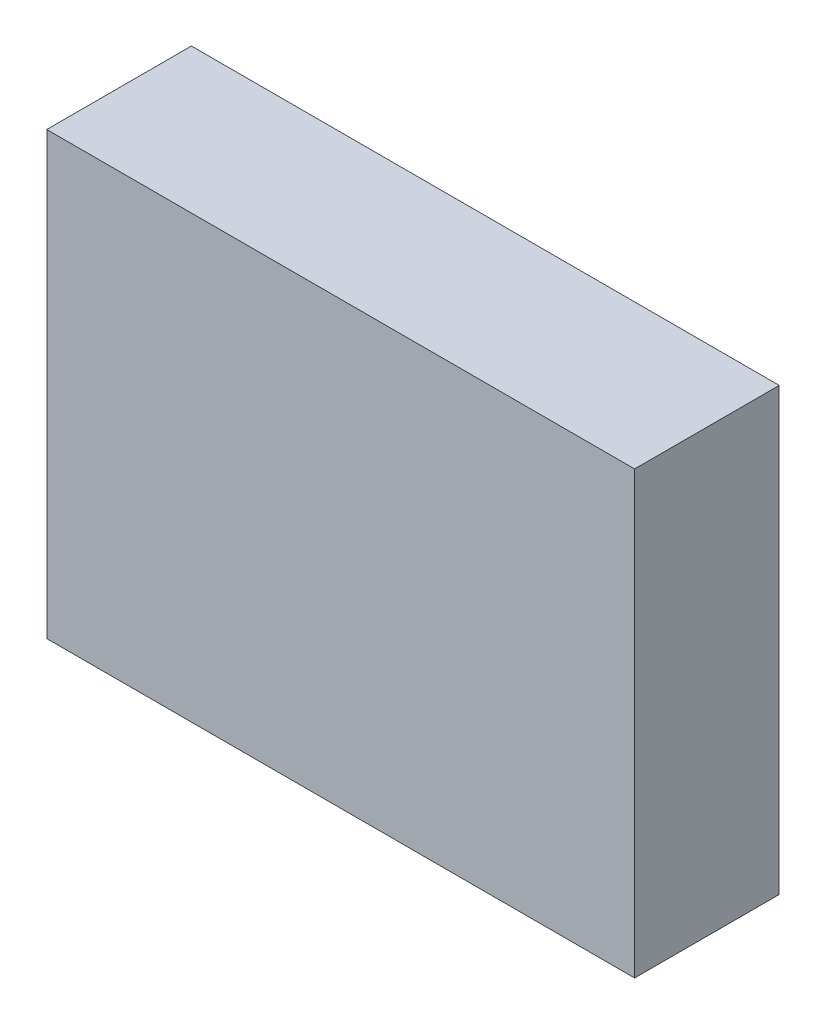
ISO-10303-21;
HEADER;
FILE_DESCRIPTION(('STEP AP214'),'2;1');
FILE_NAME('part.step','',(''),(''),'','','');
FILE_SCHEMA(('AUTOMOTIVE_DESIGN { 1 0 10303 214 1 1 1 1 }'));
ENDSEC;
DATA;
#1=APPLICATION_CONTEXT('core data for automotive mechanical design processes');
#2=APPLICATION_PROTOCOL_DEFINITION('international standard','automotive_design',2000,#1);
#3=PRODUCT_CONTEXT('',#1,'mechanical');
#4=PRODUCT('Part','Part','',(#3));
#5=PRODUCT_RELATED_PRODUCT_CATEGORY('part','',(#4));
#6=PRODUCT_DEFINITION_FORMATION('','',#4);
#7=PRODUCT_DEFINITION_CONTEXT('part definition',#1,'design');
#8=PRODUCT_DEFINITION('design','',#6,#7);
#9=PRODUCT_DEFINITION_SHAPE('','',#8);
#10=(LENGTH_UNIT() NAMED_UNIT(*) SI_UNIT(.MILLI.,.METRE.));
#11=(NAMED_UNIT(*) PLANE_ANGLE_UNIT() SI_UNIT($,.RADIAN.));
#12=(NAMED_UNIT(*) SI_UNIT($,.STERADIAN.) SOLID_ANGLE_UNIT());
#13=UNCERTAINTY_MEASURE_WITH_UNIT(LENGTH_MEASURE(1.E-05),#10,'distance_accuracy_value','');
#14=(GEOMETRIC_REPRESENTATION_CONTEXT(3) GLOBAL_UNCERTAINTY_ASSIGNED_CONTEXT((#13)) GLOBAL_UNIT_ASSIGNED_CONTEXT((#10,
#11,#12)) REPRESENTATION_CONTEXT('',''));
#15=CARTESIAN_POINT('',(0.,0.,0.));
#16=DIRECTION('',(0.,0.,1.));
#17=DIRECTION('',(1.,0.,0.));
#18=AXIS2_PLACEMENT_3D('',#15,#16,#17);
#19=CARTESIAN_POINT('',(-2.032,-1.524,1.));
#20=DIRECTION('',(1.,0.,0.));
#21=DIRECTION('',(0.,0.,-1.));
#22=AXIS2_PLACEMENT_3D('',#19,#20,#21);
#23=PLANE('',#22);
#24=DIRECTION('',(0.,-1.,0.));
#25=VECTOR('',#24,1.);
#26=CARTESIAN_POINT('',(-2.032,-1.524,0.));
#27=LINE('',#26,#25);
#28=CARTESIAN_POINT('',(-2.032,1.524,0.));
#29=VERTEX_POINT('',#28);
#30=CARTESIAN_POINT('',(-2.032,-1.524,0.));
#31=VERTEX_POINT('',#30);
#32=EDGE_CURVE('E95',#29,#31,#27,.T.);
#33=ORIENTED_EDGE('',*,*,#32,.T.);
#34=DIRECTION('',(0.,0.,-1.));
#35=VECTOR('',#34,1.);
#36=CARTESIAN_POINT('',(-2.032,-1.524,1.));
#37=LINE('',#36,#35);
#38=CARTESIAN_POINT('',(-2.032,-1.524,1.));
#39=VERTEX_POINT('',#38);
#40=EDGE_CURVE('E11',#39,#31,#37,.T.);
#41=ORIENTED_EDGE('',*,*,#40,.F.);
#42=DIRECTION('',(0.,-1.,0.));
#43=VECTOR('',#42,1.);
#44=CARTESIAN_POINT('',(-2.032,-1.524,1.));
#45=LINE('',#44,#43);
#46=CARTESIAN_POINT('',(-2.032,1.524,1.));
#47=VERTEX_POINT('',#46);
#48=EDGE_CURVE('E83',#47,#39,#45,.T.);
#49=ORIENTED_EDGE('',*,*,#48,.F.);
#50=DIRECTION('',(0.,0.,-1.));
#51=VECTOR('',#50,1.);
#52=CARTESIAN_POINT('',(-2.032,1.524,1.));
#53=LINE('',#52,#51);
#54=EDGE_CURVE('E91',#47,#29,#53,.T.);
#55=ORIENTED_EDGE('',*,*,#54,.T.);
#56=EDGE_LOOP('',(#33,#41,#49,#55));
#57=FACE_BOUND('',#56,.T.);
#58=ADVANCED_FACE('F32',(#57),#23,.F.);
#59=CARTESIAN_POINT('',(2.032,-1.524,1.));
#60=DIRECTION('',(0.,1.,0.));
#61=DIRECTION('',(0.,0.,1.));
#62=AXIS2_PLACEMENT_3D('',#59,#60,#61);
#63=PLANE('',#62);
#64=DIRECTION('',(1.,0.,0.));
#65=VECTOR('',#64,1.);
#66=CARTESIAN_POINT('',(2.032,-1.524,0.));
#67=LINE('',#66,#65);
#68=CARTESIAN_POINT('',(2.032,-1.524,0.));
#69=VERTEX_POINT('',#68);
#70=EDGE_CURVE('E87',#31,#69,#67,.T.);
#71=ORIENTED_EDGE('',*,*,#70,.T.);
#72=DIRECTION('',(0.,0.,-1.));
#73=VECTOR('',#72,1.);
#74=CARTESIAN_POINT('',(2.032,-1.524,1.));
#75=LINE('',#74,#73);
#76=CARTESIAN_POINT('',(2.032,-1.524,1.));
#77=VERTEX_POINT('',#76);
#78=EDGE_CURVE('E40',#77,#69,#75,.T.);
#79=ORIENTED_EDGE('',*,*,#78,.F.);
#80=DIRECTION('',(1.,0.,0.));
#81=VECTOR('',#80,1.);
#82=CARTESIAN_POINT('',(2.032,-1.524,1.));
#83=LINE('',#82,#81);
#84=EDGE_CURVE('E78',#39,#77,#83,.T.);
#85=ORIENTED_EDGE('',*,*,#84,.F.);
#86=ORIENTED_EDGE('',*,*,#40,.T.);
#87=EDGE_LOOP('',(#71,#79,#85,#86));
#88=FACE_BOUND('',#87,.T.);
#89=ADVANCED_FACE('F86',(#88),#63,.F.);
#90=CARTESIAN_POINT('',(2.032,1.524,1.));
#91=DIRECTION('',(-1.,0.,0.));
#92=DIRECTION('',(0.,0.,1.));
#93=AXIS2_PLACEMENT_3D('',#90,#91,#92);
#94=PLANE('',#93);
#95=DIRECTION('',(0.,1.,0.));
#96=VECTOR('',#95,1.);
#97=CARTESIAN_POINT('',(2.032,1.524,0.));
#98=LINE('',#97,#96);
#99=CARTESIAN_POINT('',(2.032,1.524,0.));
#100=VERTEX_POINT('',#99);
#101=EDGE_CURVE('E65',#69,#100,#98,.T.);
#102=ORIENTED_EDGE('',*,*,#101,.T.);
#103=DIRECTION('',(0.,0.,-1.));
#104=VECTOR('',#103,1.);
#105=CARTESIAN_POINT('',(2.032,1.524,1.));
#106=LINE('',#105,#104);
#107=CARTESIAN_POINT('',(2.032,1.524,1.));
#108=VERTEX_POINT('',#107);
#109=EDGE_CURVE('E88',#108,#100,#106,.T.);
#110=ORIENTED_EDGE('',*,*,#109,.F.);
#111=DIRECTION('',(0.,1.,0.));
#112=VECTOR('',#111,1.);
#113=CARTESIAN_POINT('',(2.032,1.524,1.));
#114=LINE('',#113,#112);
#115=EDGE_CURVE('E81',#77,#108,#114,.T.);
#116=ORIENTED_EDGE('',*,*,#115,.F.);
#117=ORIENTED_EDGE('',*,*,#78,.T.);
#118=EDGE_LOOP('',(#102,#110,#116,#117));
#119=FACE_BOUND('',#118,.T.);
#120=ADVANCED_FACE('F89',(#119),#94,.F.);
#121=CARTESIAN_POINT('',(-2.032,1.524,1.));
#122=DIRECTION('',(0.,-1.,0.));
#123=DIRECTION('',(0.,0.,-1.));
#124=AXIS2_PLACEMENT_3D('',#121,#122,#123);
#125=PLANE('',#124);
#126=DIRECTION('',(-1.,0.,0.));
#127=VECTOR('',#126,1.);
#128=CARTESIAN_POINT('',(-2.032,1.524,0.));
#129=LINE('',#128,#127);
#130=EDGE_CURVE('E71',#100,#29,#129,.T.);
#131=ORIENTED_EDGE('',*,*,#130,.T.);
#132=ORIENTED_EDGE('',*,*,#54,.F.);
#133=DIRECTION('',(-1.,0.,0.));
#134=VECTOR('',#133,1.);
#135=CARTESIAN_POINT('',(-2.032,1.524,1.));
#136=LINE('',#135,#134);
#137=EDGE_CURVE('E48',#108,#47,#136,.T.);
#138=ORIENTED_EDGE('',*,*,#137,.F.);
#139=ORIENTED_EDGE('',*,*,#109,.T.);
#140=EDGE_LOOP('',(#131,#132,#138,#139));
#141=FACE_BOUND('',#140,.T.);
#142=ADVANCED_FACE('F102',(#141),#125,.F.);
#143=CARTESIAN_POINT('',(0.,0.,1.));
#144=DIRECTION('',(0.,0.,-1.));
#145=DIRECTION('',(-1.,0.,0.));
#146=AXIS2_PLACEMENT_3D('',#143,#144,#145);
#147=PLANE('',#146);
#148=ORIENTED_EDGE('',*,*,#48,.T.);
#149=ORIENTED_EDGE('',*,*,#84,.T.);
#150=ORIENTED_EDGE('',*,*,#115,.T.);
#151=ORIENTED_EDGE('',*,*,#137,.T.);
#152=EDGE_LOOP('',(#148,#149,#150,#151));
#153=FACE_BOUND('',#152,.T.);
#154=ADVANCED_FACE('F79',(#153),#147,.F.);
#155=CARTESIAN_POINT('',(0.,0.,0.));
#156=DIRECTION('',(0.,0.,-1.));
#157=DIRECTION('',(-1.,0.,0.));
#158=AXIS2_PLACEMENT_3D('',#155,#156,#157);
#159=PLANE('',#158);
#160=ORIENTED_EDGE('',*,*,#32,.F.);
#161=ORIENTED_EDGE('',*,*,#130,.F.);
#162=ORIENTED_EDGE('',*,*,#101,.F.);
#163=ORIENTED_EDGE('',*,*,#70,.F.);
#164=EDGE_LOOP('',(#160,#161,#162,#163));
#165=FACE_BOUND('',#164,.T.);
#166=ADVANCED_FACE('F105',(#165),#159,.T.);
#167=CLOSED_SHELL('',(#58,#89,#120,#142,#154,#166));
#168=MANIFOLD_SOLID_BREP('B2',#167);
#169=ADVANCED_BREP_SHAPE_REPRESENTATION('',(#18,#168),#14);
#170=SHAPE_DEFINITION_REPRESENTATION(#9,#169);
ENDSEC;
END-ISO-10303-21;
